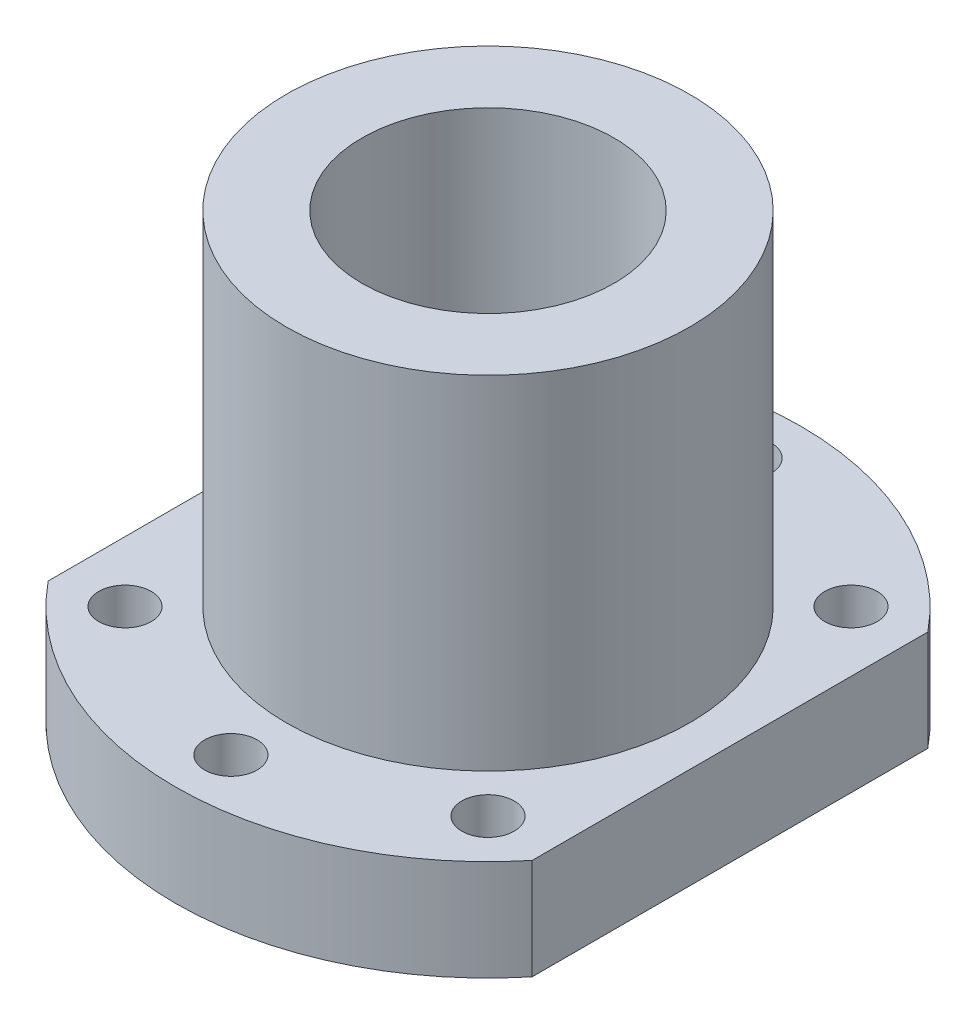
ISO-10303-21;
HEADER;
FILE_DESCRIPTION(('STEP AP214'),'2;1');
FILE_NAME('part.step','',(''),(''),'','','');
FILE_SCHEMA(('AUTOMOTIVE_DESIGN { 1 0 10303 214 1 1 1 1 }'));
ENDSEC;
DATA;
#1=APPLICATION_CONTEXT('core data for automotive mechanical design processes');
#2=APPLICATION_PROTOCOL_DEFINITION('international standard','automotive_design',2000,#1);
#3=PRODUCT_CONTEXT('',#1,'mechanical');
#4=PRODUCT('Part','Part','',(#3));
#5=PRODUCT_RELATED_PRODUCT_CATEGORY('part','',(#4));
#6=PRODUCT_DEFINITION_FORMATION('','',#4);
#7=PRODUCT_DEFINITION_CONTEXT('part definition',#1,'design');
#8=PRODUCT_DEFINITION('design','',#6,#7);
#9=PRODUCT_DEFINITION_SHAPE('','',#8);
#10=(LENGTH_UNIT() NAMED_UNIT(*) SI_UNIT(.MILLI.,.METRE.));
#11=(NAMED_UNIT(*) PLANE_ANGLE_UNIT() SI_UNIT($,.RADIAN.));
#12=(NAMED_UNIT(*) SI_UNIT($,.STERADIAN.) SOLID_ANGLE_UNIT());
#13=UNCERTAINTY_MEASURE_WITH_UNIT(LENGTH_MEASURE(1.E-05),#10,'distance_accuracy_value','');
#14=(GEOMETRIC_REPRESENTATION_CONTEXT(3) GLOBAL_UNCERTAINTY_ASSIGNED_CONTEXT((#13)) GLOBAL_UNIT_ASSIGNED_CONTEXT((#10,
#11,#12)) REPRESENTATION_CONTEXT('',''));
#15=CARTESIAN_POINT('',(0.,0.,0.));
#16=DIRECTION('',(0.,0.,1.));
#17=DIRECTION('',(1.,0.,0.));
#18=AXIS2_PLACEMENT_3D('',#15,#16,#17);
#19=CARTESIAN_POINT('',(0.,10.,0.));
#20=DIRECTION('',(0.,1.,0.));
#21=DIRECTION('',(0.,0.,1.));
#22=AXIS2_PLACEMENT_3D('',#19,#20,#21);
#23=PLANE('',#22);
#24=CARTESIAN_POINT('',(0.,10.,25.5));
#25=DIRECTION('',(0.,1.,0.));
#26=DIRECTION('',(0.,0.,1.));
#27=AXIS2_PLACEMENT_3D('',#24,#25,#26);
#28=CIRCLE('',#27,2.6);
#29=CARTESIAN_POINT('',(0.,10.,28.1));
#30=VERTEX_POINT('',#29);
#31=EDGE_CURVE('E138',#30,#30,#28,.T.);
#32=ORIENTED_EDGE('',*,*,#31,.F.);
#33=EDGE_LOOP('',(#32));
#34=FACE_BOUND('',#33,.T.);
#35=CARTESIAN_POINT('',(-18.,10.,18.));
#36=DIRECTION('',(0.,1.,0.));
#37=DIRECTION('',(0.,0.,1.));
#38=AXIS2_PLACEMENT_3D('',#35,#36,#37);
#39=CIRCLE('',#38,2.6);
#40=CARTESIAN_POINT('',(-18.,10.,20.6));
#41=VERTEX_POINT('',#40);
#42=EDGE_CURVE('E126',#41,#41,#39,.T.);
#43=ORIENTED_EDGE('',*,*,#42,.F.);
#44=EDGE_LOOP('',(#43));
#45=FACE_BOUND('',#44,.T.);
#46=CARTESIAN_POINT('',(0.,10.,-25.5));
#47=DIRECTION('',(0.,1.,0.));
#48=DIRECTION('',(0.,0.,1.));
#49=AXIS2_PLACEMENT_3D('',#46,#47,#48);
#50=CIRCLE('',#49,2.6);
#51=CARTESIAN_POINT('',(0.,10.,-22.9));
#52=VERTEX_POINT('',#51);
#53=EDGE_CURVE('E114',#52,#52,#50,.T.);
#54=ORIENTED_EDGE('',*,*,#53,.F.);
#55=EDGE_LOOP('',(#54));
#56=FACE_BOUND('',#55,.T.);
#57=CARTESIAN_POINT('',(0.,10.,0.));
#58=DIRECTION('',(0.,1.,0.));
#59=DIRECTION('',(0.,0.,1.));
#60=AXIS2_PLACEMENT_3D('',#57,#58,#59);
#61=CIRCLE('',#60,31.);
#62=CARTESIAN_POINT('',(24.,10.,-19.6214168703486));
#63=VERTEX_POINT('',#62);
#64=CARTESIAN_POINT('',(-24.,10.,-19.6214168703486));
#65=VERTEX_POINT('',#64);
#66=EDGE_CURVE('E84',#63,#65,#61,.T.);
#67=ORIENTED_EDGE('',*,*,#66,.T.);
#68=DIRECTION('',(0.,0.,1.));
#69=VECTOR('',#68,1.);
#70=CARTESIAN_POINT('',(-24.,10.,-19.6214168703486));
#71=LINE('',#70,#69);
#72=CARTESIAN_POINT('',(-24.,10.,19.6214168703486));
#73=VERTEX_POINT('',#72);
#74=EDGE_CURVE('E79',#65,#73,#71,.T.);
#75=ORIENTED_EDGE('',*,*,#74,.T.);
#76=CARTESIAN_POINT('',(0.,10.,0.));
#77=DIRECTION('',(0.,1.,0.));
#78=DIRECTION('',(0.,0.,1.));
#79=AXIS2_PLACEMENT_3D('',#76,#77,#78);
#80=CIRCLE('',#79,31.);
#81=CARTESIAN_POINT('',(24.,10.,19.6214168703486));
#82=VERTEX_POINT('',#81);
#83=EDGE_CURVE('E82',#73,#82,#80,.T.);
#84=ORIENTED_EDGE('',*,*,#83,.T.);
#85=DIRECTION('',(0.,0.,-1.));
#86=VECTOR('',#85,1.);
#87=CARTESIAN_POINT('',(24.,10.,-19.6214168703486));
#88=LINE('',#87,#86);
#89=EDGE_CURVE('E49',#82,#63,#88,.T.);
#90=ORIENTED_EDGE('',*,*,#89,.T.);
#91=EDGE_LOOP('',(#67,#75,#84,#90));
#92=FACE_BOUND('',#91,.T.);
#93=CARTESIAN_POINT('',(18.,10.,-18.));
#94=DIRECTION('',(0.,1.,0.));
#95=DIRECTION('',(0.,0.,1.));
#96=AXIS2_PLACEMENT_3D('',#93,#94,#95);
#97=CIRCLE('',#96,2.6);
#98=CARTESIAN_POINT('',(18.,10.,-15.4));
#99=VERTEX_POINT('',#98);
#100=EDGE_CURVE('E99',#99,#99,#97,.T.);
#101=ORIENTED_EDGE('',*,*,#100,.F.);
#102=EDGE_LOOP('',(#101));
#103=FACE_BOUND('',#102,.T.);
#104=CARTESIAN_POINT('',(-18.,10.,-18.));
#105=DIRECTION('',(0.,1.,0.));
#106=DIRECTION('',(0.,0.,1.));
#107=AXIS2_PLACEMENT_3D('',#104,#105,#106);
#108=CIRCLE('',#107,2.6);
#109=CARTESIAN_POINT('',(-18.,10.,-15.4));
#110=VERTEX_POINT('',#109);
#111=EDGE_CURVE('E120',#110,#110,#108,.T.);
#112=ORIENTED_EDGE('',*,*,#111,.F.);
#113=EDGE_LOOP('',(#112));
#114=FACE_BOUND('',#113,.T.);
#115=CARTESIAN_POINT('',(18.,10.,18.));
#116=DIRECTION('',(0.,1.,0.));
#117=DIRECTION('',(0.,0.,1.));
#118=AXIS2_PLACEMENT_3D('',#115,#116,#117);
#119=CIRCLE('',#118,2.6);
#120=CARTESIAN_POINT('',(18.,10.,20.6));
#121=VERTEX_POINT('',#120);
#122=EDGE_CURVE('E132',#121,#121,#119,.T.);
#123=ORIENTED_EDGE('',*,*,#122,.F.);
#124=EDGE_LOOP('',(#123));
#125=FACE_BOUND('',#124,.T.);
#126=CARTESIAN_POINT('',(0.,10.,0.));
#127=DIRECTION('',(0.,1.,0.));
#128=DIRECTION('',(0.,0.,1.));
#129=AXIS2_PLACEMENT_3D('',#126,#127,#128);
#130=CIRCLE('',#129,20.);
#131=CARTESIAN_POINT('',(0.,10.,20.));
#132=VERTEX_POINT('',#131);
#133=EDGE_CURVE('E147',#132,#132,#130,.T.);
#134=ORIENTED_EDGE('',*,*,#133,.F.);
#135=EDGE_LOOP('',(#134));
#136=FACE_BOUND('',#135,.T.);
#137=ADVANCED_FACE('F32',(#34,#45,#56,#92,#103,#114,#125,#136),#23,.T.);
#138=CARTESIAN_POINT('',(0.,0.,0.));
#139=DIRECTION('',(0.,1.,0.));
#140=DIRECTION('',(0.,0.,1.));
#141=AXIS2_PLACEMENT_3D('',#138,#139,#140);
#142=PLANE('',#141);
#143=CARTESIAN_POINT('',(0.,0.,0.));
#144=DIRECTION('',(0.,1.,0.));
#145=DIRECTION('',(0.,0.,1.));
#146=AXIS2_PLACEMENT_3D('',#143,#144,#145);
#147=CIRCLE('',#146,12.5);
#148=CARTESIAN_POINT('',(0.,0.,12.5));
#149=VERTEX_POINT('',#148);
#150=EDGE_CURVE('E150',#149,#149,#147,.F.);
#151=ORIENTED_EDGE('',*,*,#150,.F.);
#152=EDGE_LOOP('',(#151));
#153=FACE_BOUND('',#152,.T.);
#154=CARTESIAN_POINT('',(18.,0.,18.));
#155=DIRECTION('',(0.,1.,0.));
#156=DIRECTION('',(0.,0.,1.));
#157=AXIS2_PLACEMENT_3D('',#154,#155,#156);
#158=CIRCLE('',#157,2.6);
#159=CARTESIAN_POINT('',(18.,0.,20.6));
#160=VERTEX_POINT('',#159);
#161=EDGE_CURVE('E135',#160,#160,#158,.T.);
#162=ORIENTED_EDGE('',*,*,#161,.T.);
#163=EDGE_LOOP('',(#162));
#164=FACE_BOUND('',#163,.T.);
#165=CARTESIAN_POINT('',(-18.,0.,-18.));
#166=DIRECTION('',(0.,1.,0.));
#167=DIRECTION('',(0.,0.,1.));
#168=AXIS2_PLACEMENT_3D('',#165,#166,#167);
#169=CIRCLE('',#168,2.6);
#170=CARTESIAN_POINT('',(-18.,0.,-15.4));
#171=VERTEX_POINT('',#170);
#172=EDGE_CURVE('E123',#171,#171,#169,.T.);
#173=ORIENTED_EDGE('',*,*,#172,.T.);
#174=EDGE_LOOP('',(#173));
#175=FACE_BOUND('',#174,.T.);
#176=CARTESIAN_POINT('',(18.,0.,-18.));
#177=DIRECTION('',(0.,1.,0.));
#178=DIRECTION('',(0.,0.,1.));
#179=AXIS2_PLACEMENT_3D('',#176,#177,#178);
#180=CIRCLE('',#179,2.6);
#181=CARTESIAN_POINT('',(18.,0.,-15.4));
#182=VERTEX_POINT('',#181);
#183=EDGE_CURVE('E111',#182,#182,#180,.T.);
#184=ORIENTED_EDGE('',*,*,#183,.T.);
#185=EDGE_LOOP('',(#184));
#186=FACE_BOUND('',#185,.T.);
#187=CARTESIAN_POINT('',(0.,0.,0.));
#188=DIRECTION('',(0.,1.,0.));
#189=DIRECTION('',(0.,0.,1.));
#190=AXIS2_PLACEMENT_3D('',#187,#188,#189);
#191=CIRCLE('',#190,31.);
#192=CARTESIAN_POINT('',(24.,0.,-19.6214168703486));
#193=VERTEX_POINT('',#192);
#194=CARTESIAN_POINT('',(-24.,0.,-19.6214168703486));
#195=VERTEX_POINT('',#194);
#196=EDGE_CURVE('E96',#193,#195,#191,.T.);
#197=ORIENTED_EDGE('',*,*,#196,.F.);
#198=DIRECTION('',(0.,0.,-1.));
#199=VECTOR('',#198,1.);
#200=CARTESIAN_POINT('',(24.,0.,-19.6214168703486));
#201=LINE('',#200,#199);
#202=CARTESIAN_POINT('',(24.,0.,19.6214168703486));
#203=VERTEX_POINT('',#202);
#204=EDGE_CURVE('E72',#203,#193,#201,.T.);
#205=ORIENTED_EDGE('',*,*,#204,.F.);
#206=CARTESIAN_POINT('',(0.,0.,0.));
#207=DIRECTION('',(0.,1.,0.));
#208=DIRECTION('',(0.,0.,1.));
#209=AXIS2_PLACEMENT_3D('',#206,#207,#208);
#210=CIRCLE('',#209,31.);
#211=CARTESIAN_POINT('',(-24.,0.,19.6214168703486));
#212=VERTEX_POINT('',#211);
#213=EDGE_CURVE('E66',#212,#203,#210,.T.);
#214=ORIENTED_EDGE('',*,*,#213,.F.);
#215=DIRECTION('',(0.,0.,1.));
#216=VECTOR('',#215,1.);
#217=CARTESIAN_POINT('',(-24.,0.,-19.6214168703486));
#218=LINE('',#217,#216);
#219=EDGE_CURVE('E88',#195,#212,#218,.T.);
#220=ORIENTED_EDGE('',*,*,#219,.F.);
#221=EDGE_LOOP('',(#197,#205,#214,#220));
#222=FACE_BOUND('',#221,.T.);
#223=CARTESIAN_POINT('',(0.,0.,-25.5));
#224=DIRECTION('',(0.,1.,0.));
#225=DIRECTION('',(0.,0.,1.));
#226=AXIS2_PLACEMENT_3D('',#223,#224,#225);
#227=CIRCLE('',#226,2.6);
#228=CARTESIAN_POINT('',(0.,0.,-22.9));
#229=VERTEX_POINT('',#228);
#230=EDGE_CURVE('E117',#229,#229,#227,.T.);
#231=ORIENTED_EDGE('',*,*,#230,.T.);
#232=EDGE_LOOP('',(#231));
#233=FACE_BOUND('',#232,.T.);
#234=CARTESIAN_POINT('',(-18.,0.,18.));
#235=DIRECTION('',(0.,1.,0.));
#236=DIRECTION('',(0.,0.,1.));
#237=AXIS2_PLACEMENT_3D('',#234,#235,#236);
#238=CIRCLE('',#237,2.6);
#239=CARTESIAN_POINT('',(-18.,0.,20.6));
#240=VERTEX_POINT('',#239);
#241=EDGE_CURVE('E129',#240,#240,#238,.T.);
#242=ORIENTED_EDGE('',*,*,#241,.T.);
#243=EDGE_LOOP('',(#242));
#244=FACE_BOUND('',#243,.T.);
#245=CARTESIAN_POINT('',(0.,0.,25.5));
#246=DIRECTION('',(0.,1.,0.));
#247=DIRECTION('',(0.,0.,1.));
#248=AXIS2_PLACEMENT_3D('',#245,#246,#247);
#249=CIRCLE('',#248,2.6);
#250=CARTESIAN_POINT('',(0.,0.,28.1));
#251=VERTEX_POINT('',#250);
#252=EDGE_CURVE('E141',#251,#251,#249,.T.);
#253=ORIENTED_EDGE('',*,*,#252,.T.);
#254=EDGE_LOOP('',(#253));
#255=FACE_BOUND('',#254,.T.);
#256=ADVANCED_FACE('F107',(#153,#164,#175,#186,#222,#233,#244,#255),#142,.F.);
#257=CARTESIAN_POINT('',(0.,10.,0.));
#258=DIRECTION('',(0.,-1.,0.));
#259=DIRECTION('',(0.,0.,-1.));
#260=AXIS2_PLACEMENT_3D('',#257,#258,#259);
#261=CYLINDRICAL_SURFACE('',#260,31.);
#262=ORIENTED_EDGE('',*,*,#196,.T.);
#263=DIRECTION('',(0.,-1.,0.));
#264=VECTOR('',#263,1.);
#265=CARTESIAN_POINT('',(-24.,10.,-19.6214168703486));
#266=LINE('',#265,#264);
#267=EDGE_CURVE('E11',#65,#195,#266,.T.);
#268=ORIENTED_EDGE('',*,*,#267,.F.);
#269=ORIENTED_EDGE('',*,*,#66,.F.);
#270=DIRECTION('',(0.,-1.,0.));
#271=VECTOR('',#270,1.);
#272=CARTESIAN_POINT('',(24.,10.,-19.6214168703486));
#273=LINE('',#272,#271);
#274=EDGE_CURVE('E92',#63,#193,#273,.T.);
#275=ORIENTED_EDGE('',*,*,#274,.T.);
#276=EDGE_LOOP('',(#262,#268,#269,#275));
#277=FACE_BOUND('',#276,.T.);
#278=ADVANCED_FACE('F34',(#277),#261,.T.);
#279=CARTESIAN_POINT('',(-24.,10.,-19.6214168703486));
#280=DIRECTION('',(1.,0.,0.));
#281=DIRECTION('',(0.,0.,-1.));
#282=AXIS2_PLACEMENT_3D('',#279,#280,#281);
#283=PLANE('',#282);
#284=ORIENTED_EDGE('',*,*,#219,.T.);
#285=DIRECTION('',(0.,-1.,0.));
#286=VECTOR('',#285,1.);
#287=CARTESIAN_POINT('',(-24.,10.,19.6214168703486));
#288=LINE('',#287,#286);
#289=EDGE_CURVE('E41',#73,#212,#288,.T.);
#290=ORIENTED_EDGE('',*,*,#289,.F.);
#291=ORIENTED_EDGE('',*,*,#74,.F.);
#292=ORIENTED_EDGE('',*,*,#267,.T.);
#293=EDGE_LOOP('',(#284,#290,#291,#292));
#294=FACE_BOUND('',#293,.T.);
#295=ADVANCED_FACE('F87',(#294),#283,.F.);
#296=CARTESIAN_POINT('',(0.,10.,0.));
#297=DIRECTION('',(0.,-1.,0.));
#298=DIRECTION('',(0.,0.,-1.));
#299=AXIS2_PLACEMENT_3D('',#296,#297,#298);
#300=CYLINDRICAL_SURFACE('',#299,31.);
#301=ORIENTED_EDGE('',*,*,#213,.T.);
#302=DIRECTION('',(0.,-1.,0.));
#303=VECTOR('',#302,1.);
#304=CARTESIAN_POINT('',(24.,10.,19.6214168703486));
#305=LINE('',#304,#303);
#306=EDGE_CURVE('E89',#82,#203,#305,.T.);
#307=ORIENTED_EDGE('',*,*,#306,.F.);
#308=ORIENTED_EDGE('',*,*,#83,.F.);
#309=ORIENTED_EDGE('',*,*,#289,.T.);
#310=EDGE_LOOP('',(#301,#307,#308,#309));
#311=FACE_BOUND('',#310,.T.);
#312=ADVANCED_FACE('F90',(#311),#300,.T.);
#313=CARTESIAN_POINT('',(24.,10.,-19.6214168703486));
#314=DIRECTION('',(-1.,0.,0.));
#315=DIRECTION('',(0.,0.,1.));
#316=AXIS2_PLACEMENT_3D('',#313,#314,#315);
#317=PLANE('',#316);
#318=ORIENTED_EDGE('',*,*,#204,.T.);
#319=ORIENTED_EDGE('',*,*,#274,.F.);
#320=ORIENTED_EDGE('',*,*,#89,.F.);
#321=ORIENTED_EDGE('',*,*,#306,.T.);
#322=EDGE_LOOP('',(#318,#319,#320,#321));
#323=FACE_BOUND('',#322,.T.);
#324=ADVANCED_FACE('F104',(#323),#317,.F.);
#325=CARTESIAN_POINT('',(18.,10.,-18.));
#326=DIRECTION('',(0.,-1.,0.));
#327=DIRECTION('',(0.,0.,-1.));
#328=AXIS2_PLACEMENT_3D('',#325,#326,#327);
#329=CYLINDRICAL_SURFACE('',#328,2.6);
#330=ORIENTED_EDGE('',*,*,#100,.T.);
#331=EDGE_LOOP('',(#330));
#332=FACE_BOUND('',#331,.T.);
#333=ORIENTED_EDGE('',*,*,#183,.F.);
#334=EDGE_LOOP('',(#333));
#335=FACE_BOUND('',#334,.T.);
#336=ADVANCED_FACE('F186',(#332,#335),#329,.F.);
#337=CARTESIAN_POINT('',(0.,10.,-25.5));
#338=DIRECTION('',(0.,-1.,0.));
#339=DIRECTION('',(0.,0.,-1.));
#340=AXIS2_PLACEMENT_3D('',#337,#338,#339);
#341=CYLINDRICAL_SURFACE('',#340,2.6);
#342=ORIENTED_EDGE('',*,*,#53,.T.);
#343=EDGE_LOOP('',(#342));
#344=FACE_BOUND('',#343,.T.);
#345=ORIENTED_EDGE('',*,*,#230,.F.);
#346=EDGE_LOOP('',(#345));
#347=FACE_BOUND('',#346,.T.);
#348=ADVANCED_FACE('F237',(#344,#347),#341,.F.);
#349=CARTESIAN_POINT('',(-18.,10.,-18.));
#350=DIRECTION('',(0.,-1.,0.));
#351=DIRECTION('',(0.,0.,-1.));
#352=AXIS2_PLACEMENT_3D('',#349,#350,#351);
#353=CYLINDRICAL_SURFACE('',#352,2.6);
#354=ORIENTED_EDGE('',*,*,#111,.T.);
#355=EDGE_LOOP('',(#354));
#356=FACE_BOUND('',#355,.T.);
#357=ORIENTED_EDGE('',*,*,#172,.F.);
#358=EDGE_LOOP('',(#357));
#359=FACE_BOUND('',#358,.T.);
#360=ADVANCED_FACE('F234',(#356,#359),#353,.F.);
#361=CARTESIAN_POINT('',(-18.,10.,18.));
#362=DIRECTION('',(0.,-1.,0.));
#363=DIRECTION('',(0.,0.,-1.));
#364=AXIS2_PLACEMENT_3D('',#361,#362,#363);
#365=CYLINDRICAL_SURFACE('',#364,2.6);
#366=ORIENTED_EDGE('',*,*,#42,.T.);
#367=EDGE_LOOP('',(#366));
#368=FACE_BOUND('',#367,.T.);
#369=ORIENTED_EDGE('',*,*,#241,.F.);
#370=EDGE_LOOP('',(#369));
#371=FACE_BOUND('',#370,.T.);
#372=ADVANCED_FACE('F230',(#368,#371),#365,.F.);
#373=CARTESIAN_POINT('',(18.,10.,18.));
#374=DIRECTION('',(0.,-1.,0.));
#375=DIRECTION('',(0.,0.,-1.));
#376=AXIS2_PLACEMENT_3D('',#373,#374,#375);
#377=CYLINDRICAL_SURFACE('',#376,2.6);
#378=ORIENTED_EDGE('',*,*,#122,.T.);
#379=EDGE_LOOP('',(#378));
#380=FACE_BOUND('',#379,.T.);
#381=ORIENTED_EDGE('',*,*,#161,.F.);
#382=EDGE_LOOP('',(#381));
#383=FACE_BOUND('',#382,.T.);
#384=ADVANCED_FACE('F226',(#380,#383),#377,.F.);
#385=CARTESIAN_POINT('',(0.,10.,25.5));
#386=DIRECTION('',(0.,-1.,0.));
#387=DIRECTION('',(0.,0.,-1.));
#388=AXIS2_PLACEMENT_3D('',#385,#386,#387);
#389=CYLINDRICAL_SURFACE('',#388,2.6);
#390=ORIENTED_EDGE('',*,*,#31,.T.);
#391=EDGE_LOOP('',(#390));
#392=FACE_BOUND('',#391,.T.);
#393=ORIENTED_EDGE('',*,*,#252,.F.);
#394=EDGE_LOOP('',(#393));
#395=FACE_BOUND('',#394,.T.);
#396=ADVANCED_FACE('F171',(#392,#395),#389,.F.);
#397=CARTESIAN_POINT('',(0.,44.,0.));
#398=DIRECTION('',(0.,-1.,0.));
#399=DIRECTION('',(0.,0.,-1.));
#400=AXIS2_PLACEMENT_3D('',#397,#398,#399);
#401=CYLINDRICAL_SURFACE('',#400,20.);
#402=CARTESIAN_POINT('',(0.,44.,0.));
#403=DIRECTION('',(0.,1.,0.));
#404=DIRECTION('',(0.,0.,1.));
#405=AXIS2_PLACEMENT_3D('',#402,#403,#404);
#406=CIRCLE('',#405,20.);
#407=CARTESIAN_POINT('',(0.,44.,20.));
#408=VERTEX_POINT('',#407);
#409=EDGE_CURVE('E144',#408,#408,#406,.T.);
#410=ORIENTED_EDGE('',*,*,#409,.F.);
#411=EDGE_LOOP('',(#410));
#412=FACE_BOUND('',#411,.T.);
#413=ORIENTED_EDGE('',*,*,#133,.T.);
#414=EDGE_LOOP('',(#413));
#415=FACE_BOUND('',#414,.T.);
#416=ADVANCED_FACE('F165',(#412,#415),#401,.T.);
#417=CARTESIAN_POINT('',(0.,44.,0.));
#418=DIRECTION('',(0.,1.,0.));
#419=DIRECTION('',(0.,0.,1.));
#420=AXIS2_PLACEMENT_3D('',#417,#418,#419);
#421=PLANE('',#420);
#422=CARTESIAN_POINT('',(0.,44.,0.));
#423=DIRECTION('',(0.,1.,0.));
#424=DIRECTION('',(0.,0.,1.));
#425=AXIS2_PLACEMENT_3D('',#422,#423,#424);
#426=CIRCLE('',#425,12.5);
#427=CARTESIAN_POINT('',(0.,44.,12.5));
#428=VERTEX_POINT('',#427);
#429=EDGE_CURVE('E155',#428,#428,#426,.T.);
#430=ORIENTED_EDGE('',*,*,#429,.F.);
#431=EDGE_LOOP('',(#430));
#432=FACE_BOUND('',#431,.T.);
#433=ORIENTED_EDGE('',*,*,#409,.T.);
#434=EDGE_LOOP('',(#433));
#435=FACE_BOUND('',#434,.T.);
#436=ADVANCED_FACE('F162',(#432,#435),#421,.T.);
#437=CARTESIAN_POINT('',(0.,-0.001000000000001,0.));
#438=DIRECTION('',(0.,1.,0.));
#439=DIRECTION('',(0.,0.,1.));
#440=AXIS2_PLACEMENT_3D('',#437,#438,#439);
#441=CYLINDRICAL_SURFACE('',#440,12.5);
#442=ORIENTED_EDGE('',*,*,#429,.T.);
#443=EDGE_LOOP('',(#442));
#444=FACE_BOUND('',#443,.T.);
#445=ORIENTED_EDGE('',*,*,#150,.T.);
#446=EDGE_LOOP('',(#445));
#447=FACE_BOUND('',#446,.T.);
#448=ADVANCED_FACE('F159',(#444,#447),#441,.F.);
#449=CLOSED_SHELL('',(#137,#256,#278,#295,#312,#324,#336,#348,#360,#372,#384,#396,#416,#436,#448));
#450=MANIFOLD_SOLID_BREP('B2',#449);
#451=ADVANCED_BREP_SHAPE_REPRESENTATION('',(#18,#450),#14);
#452=SHAPE_DEFINITION_REPRESENTATION(#9,#451);
ENDSEC;
END-ISO-10303-21;
